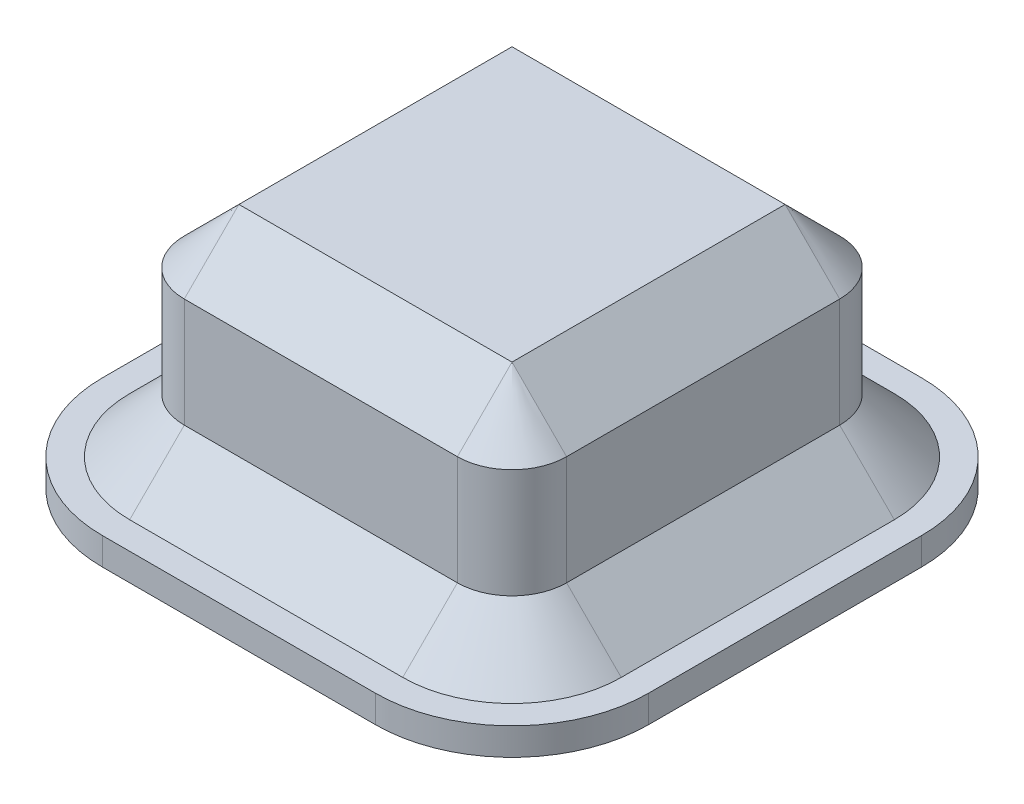
ISO-10303-21;
HEADER;
FILE_DESCRIPTION(('STEP AP214'),'2;1');
FILE_NAME('part.step','',(''),(''),'','','');
FILE_SCHEMA(('AUTOMOTIVE_DESIGN { 1 0 10303 214 1 1 1 1 }'));
ENDSEC;
DATA;
#1=APPLICATION_CONTEXT('core data for automotive mechanical design processes');
#2=APPLICATION_PROTOCOL_DEFINITION('international standard','automotive_design',2000,#1);
#3=PRODUCT_CONTEXT('',#1,'mechanical');
#4=PRODUCT('Part','Part','',(#3));
#5=PRODUCT_RELATED_PRODUCT_CATEGORY('part','',(#4));
#6=PRODUCT_DEFINITION_FORMATION('','',#4);
#7=PRODUCT_DEFINITION_CONTEXT('part definition',#1,'design');
#8=PRODUCT_DEFINITION('design','',#6,#7);
#9=PRODUCT_DEFINITION_SHAPE('','',#8);
#10=(LENGTH_UNIT() NAMED_UNIT(*) SI_UNIT(.MILLI.,.METRE.));
#11=(NAMED_UNIT(*) PLANE_ANGLE_UNIT() SI_UNIT($,.RADIAN.));
#12=(NAMED_UNIT(*) SI_UNIT($,.STERADIAN.) SOLID_ANGLE_UNIT());
#13=UNCERTAINTY_MEASURE_WITH_UNIT(LENGTH_MEASURE(1.E-05),#10,'distance_accuracy_value','');
#14=(GEOMETRIC_REPRESENTATION_CONTEXT(3) GLOBAL_UNCERTAINTY_ASSIGNED_CONTEXT((#13)) GLOBAL_UNIT_ASSIGNED_CONTEXT((#10,
#11,#12)) REPRESENTATION_CONTEXT('',''));
#15=CARTESIAN_POINT('',(0.,0.,0.));
#16=DIRECTION('',(0.,0.,1.));
#17=DIRECTION('',(1.,0.,0.));
#18=AXIS2_PLACEMENT_3D('',#15,#16,#17);
#19=CARTESIAN_POINT('',(10.,1.,-10.));
#20=DIRECTION('',(-1.,0.,0.));
#21=DIRECTION('',(0.,0.,1.));
#22=AXIS2_PLACEMENT_3D('',#19,#20,#21);
#23=PLANE('',#22);
#24=DIRECTION('',(0.,0.,-1.));
#25=VECTOR('',#24,1.);
#26=CARTESIAN_POINT('',(10.,0.,-10.));
#27=LINE('',#26,#25);
#28=CARTESIAN_POINT('',(10.,0.,5.));
#29=VERTEX_POINT('',#28);
#30=CARTESIAN_POINT('',(10.,0.,-5.));
#31=VERTEX_POINT('',#30);
#32=EDGE_CURVE('E452',#29,#31,#27,.T.);
#33=ORIENTED_EDGE('',*,*,#32,.T.);
#34=DIRECTION('',(0.,-1.,0.));
#35=VECTOR('',#34,1.);
#36=CARTESIAN_POINT('',(10.,1.,-5.));
#37=LINE('',#36,#35);
#38=CARTESIAN_POINT('',(10.,1.,-5.));
#39=VERTEX_POINT('',#38);
#40=EDGE_CURVE('E266',#31,#39,#37,.F.);
#41=ORIENTED_EDGE('',*,*,#40,.T.);
#42=DIRECTION('',(0.,0.,-1.));
#43=VECTOR('',#42,1.);
#44=CARTESIAN_POINT('',(10.,1.,-10.));
#45=LINE('',#44,#43);
#46=CARTESIAN_POINT('',(10.,1.,5.));
#47=VERTEX_POINT('',#46);
#48=EDGE_CURVE('E217',#47,#39,#45,.T.);
#49=ORIENTED_EDGE('',*,*,#48,.F.);
#50=DIRECTION('',(0.,-1.,0.));
#51=VECTOR('',#50,1.);
#52=CARTESIAN_POINT('',(10.,1.,5.));
#53=LINE('',#52,#51);
#54=EDGE_CURVE('E262',#47,#29,#53,.T.);
#55=ORIENTED_EDGE('',*,*,#54,.T.);
#56=EDGE_LOOP('',(#33,#41,#49,#55));
#57=FACE_BOUND('',#56,.T.);
#58=ADVANCED_FACE('F38',(#57),#23,.F.);
#59=CARTESIAN_POINT('',(-10.,1.,-10.));
#60=DIRECTION('',(0.,0.,1.));
#61=DIRECTION('',(1.,0.,0.));
#62=AXIS2_PLACEMENT_3D('',#59,#60,#61);
#63=PLANE('',#62);
#64=DIRECTION('',(-1.,0.,0.));
#65=VECTOR('',#64,1.);
#66=CARTESIAN_POINT('',(-10.,0.,-10.));
#67=LINE('',#66,#65);
#68=CARTESIAN_POINT('',(5.,0.,-10.));
#69=VERTEX_POINT('',#68);
#70=CARTESIAN_POINT('',(-5.,0.,-10.));
#71=VERTEX_POINT('',#70);
#72=EDGE_CURVE('E225',#69,#71,#67,.T.);
#73=ORIENTED_EDGE('',*,*,#72,.T.);
#74=DIRECTION('',(0.,-1.,0.));
#75=VECTOR('',#74,1.);
#76=CARTESIAN_POINT('',(-5.,1.,-10.));
#77=LINE('',#76,#75);
#78=CARTESIAN_POINT('',(-5.,1.,-10.));
#79=VERTEX_POINT('',#78);
#80=EDGE_CURVE('E259',#71,#79,#77,.F.);
#81=ORIENTED_EDGE('',*,*,#80,.T.);
#82=DIRECTION('',(-1.,0.,0.));
#83=VECTOR('',#82,1.);
#84=CARTESIAN_POINT('',(-10.,1.,-10.));
#85=LINE('',#84,#83);
#86=CARTESIAN_POINT('',(5.,1.,-10.));
#87=VERTEX_POINT('',#86);
#88=EDGE_CURVE('E223',#87,#79,#85,.T.);
#89=ORIENTED_EDGE('',*,*,#88,.F.);
#90=DIRECTION('',(0.,-1.,0.));
#91=VECTOR('',#90,1.);
#92=CARTESIAN_POINT('',(5.,1.,-10.));
#93=LINE('',#92,#91);
#94=EDGE_CURVE('E255',#87,#69,#93,.T.);
#95=ORIENTED_EDGE('',*,*,#94,.T.);
#96=EDGE_LOOP('',(#73,#81,#89,#95));
#97=FACE_BOUND('',#96,.T.);
#98=ADVANCED_FACE('F470',(#97),#63,.F.);
#99=CARTESIAN_POINT('',(-10.,1.,-10.));
#100=DIRECTION('',(1.,0.,0.));
#101=DIRECTION('',(0.,0.,-1.));
#102=AXIS2_PLACEMENT_3D('',#99,#100,#101);
#103=PLANE('',#102);
#104=DIRECTION('',(0.,0.,1.));
#105=VECTOR('',#104,1.);
#106=CARTESIAN_POINT('',(-10.,0.,-10.));
#107=LINE('',#106,#105);
#108=CARTESIAN_POINT('',(-10.,0.,-5.));
#109=VERTEX_POINT('',#108);
#110=CARTESIAN_POINT('',(-10.,0.,5.));
#111=VERTEX_POINT('',#110);
#112=EDGE_CURVE('E218',#109,#111,#107,.T.);
#113=ORIENTED_EDGE('',*,*,#112,.T.);
#114=DIRECTION('',(0.,-1.,0.));
#115=VECTOR('',#114,1.);
#116=CARTESIAN_POINT('',(-10.,1.,5.));
#117=LINE('',#116,#115);
#118=CARTESIAN_POINT('',(-10.,1.,5.));
#119=VERTEX_POINT('',#118);
#120=EDGE_CURVE('E193',#111,#119,#117,.F.);
#121=ORIENTED_EDGE('',*,*,#120,.T.);
#122=DIRECTION('',(0.,0.,1.));
#123=VECTOR('',#122,1.);
#124=CARTESIAN_POINT('',(-10.,1.,-10.));
#125=LINE('',#124,#123);
#126=CARTESIAN_POINT('',(-10.,1.,-5.));
#127=VERTEX_POINT('',#126);
#128=EDGE_CURVE('E457',#127,#119,#125,.T.);
#129=ORIENTED_EDGE('',*,*,#128,.F.);
#130=DIRECTION('',(0.,-1.,0.));
#131=VECTOR('',#130,1.);
#132=CARTESIAN_POINT('',(-10.,1.,-5.));
#133=LINE('',#132,#131);
#134=EDGE_CURVE('E199',#127,#109,#133,.T.);
#135=ORIENTED_EDGE('',*,*,#134,.T.);
#136=EDGE_LOOP('',(#113,#121,#129,#135));
#137=FACE_BOUND('',#136,.T.);
#138=ADVANCED_FACE('F481',(#137),#103,.F.);
#139=CARTESIAN_POINT('',(-10.,1.,10.));
#140=DIRECTION('',(0.,0.,-1.));
#141=DIRECTION('',(-1.,0.,0.));
#142=AXIS2_PLACEMENT_3D('',#139,#140,#141);
#143=PLANE('',#142);
#144=DIRECTION('',(1.,0.,0.));
#145=VECTOR('',#144,1.);
#146=CARTESIAN_POINT('',(-10.,1.,10.));
#147=LINE('',#146,#145);
#148=CARTESIAN_POINT('',(-5.,1.,10.));
#149=VERTEX_POINT('',#148);
#150=CARTESIAN_POINT('',(5.,1.,10.));
#151=VERTEX_POINT('',#150);
#152=EDGE_CURVE('E209',#149,#151,#147,.T.);
#153=ORIENTED_EDGE('',*,*,#152,.F.);
#154=DIRECTION('',(0.,-1.,0.));
#155=VECTOR('',#154,1.);
#156=CARTESIAN_POINT('',(-5.,1.,10.));
#157=LINE('',#156,#155);
#158=CARTESIAN_POINT('',(-5.,0.,10.));
#159=VERTEX_POINT('',#158);
#160=EDGE_CURVE('E192',#149,#159,#157,.T.);
#161=ORIENTED_EDGE('',*,*,#160,.T.);
#162=DIRECTION('',(1.,0.,0.));
#163=VECTOR('',#162,1.);
#164=CARTESIAN_POINT('',(-10.,0.,10.));
#165=LINE('',#164,#163);
#166=CARTESIAN_POINT('',(5.,0.,10.));
#167=VERTEX_POINT('',#166);
#168=EDGE_CURVE('E206',#159,#167,#165,.T.);
#169=ORIENTED_EDGE('',*,*,#168,.T.);
#170=DIRECTION('',(0.,-1.,0.));
#171=VECTOR('',#170,1.);
#172=CARTESIAN_POINT('',(5.,1.,10.));
#173=LINE('',#172,#171);
#174=EDGE_CURVE('E212',#167,#151,#173,.F.);
#175=ORIENTED_EDGE('',*,*,#174,.T.);
#176=EDGE_LOOP('',(#153,#161,#169,#175));
#177=FACE_BOUND('',#176,.T.);
#178=ADVANCED_FACE('F205',(#177),#143,.F.);
#179=CARTESIAN_POINT('',(0.,1.,0.));
#180=DIRECTION('',(0.,1.,0.));
#181=DIRECTION('',(0.,0.,1.));
#182=AXIS2_PLACEMENT_3D('',#179,#180,#181);
#183=PLANE('',#182);
#184=DIRECTION('',(0.,0.,1.));
#185=VECTOR('',#184,1.);
#186=CARTESIAN_POINT('',(9.,1.,0.));
#187=LINE('',#186,#185);
#188=CARTESIAN_POINT('',(9.,1.,-5.));
#189=VERTEX_POINT('',#188);
#190=CARTESIAN_POINT('',(9.,1.,5.));
#191=VERTEX_POINT('',#190);
#192=EDGE_CURVE('E291',#189,#191,#187,.T.);
#193=ORIENTED_EDGE('',*,*,#192,.T.);
#194=CARTESIAN_POINT('',(5.,1.,5.));
#195=DIRECTION('',(0.,1.,0.));
#196=DIRECTION('',(0.,0.,1.));
#197=AXIS2_PLACEMENT_3D('',#194,#195,#196);
#198=CIRCLE('',#197,4.);
#199=CARTESIAN_POINT('',(5.,1.,8.99999999999999));
#200=VERTEX_POINT('',#199);
#201=EDGE_CURVE('E294',#191,#200,#198,.F.);
#202=ORIENTED_EDGE('',*,*,#201,.T.);
#203=DIRECTION('',(-1.,0.,0.));
#204=VECTOR('',#203,1.);
#205=CARTESIAN_POINT('',(0.,1.,8.99999999999999));
#206=LINE('',#205,#204);
#207=CARTESIAN_POINT('',(-5.,1.,8.99999999999999));
#208=VERTEX_POINT('',#207);
#209=EDGE_CURVE('E279',#200,#208,#206,.T.);
#210=ORIENTED_EDGE('',*,*,#209,.T.);
#211=CARTESIAN_POINT('',(-5.,1.,5.));
#212=DIRECTION('',(0.,1.,0.));
#213=DIRECTION('',(0.,0.,1.));
#214=AXIS2_PLACEMENT_3D('',#211,#212,#213);
#215=CIRCLE('',#214,4.);
#216=CARTESIAN_POINT('',(-8.99999999999999,1.,5.));
#217=VERTEX_POINT('',#216);
#218=EDGE_CURVE('E276',#208,#217,#215,.F.);
#219=ORIENTED_EDGE('',*,*,#218,.T.);
#220=DIRECTION('',(0.,0.,-1.));
#221=VECTOR('',#220,1.);
#222=CARTESIAN_POINT('',(-8.99999999999999,1.,0.));
#223=LINE('',#222,#221);
#224=CARTESIAN_POINT('',(-8.99999999999999,1.,-5.));
#225=VERTEX_POINT('',#224);
#226=EDGE_CURVE('E273',#217,#225,#223,.T.);
#227=ORIENTED_EDGE('',*,*,#226,.T.);
#228=CARTESIAN_POINT('',(-5.,1.,-5.));
#229=DIRECTION('',(0.,1.,0.));
#230=DIRECTION('',(0.,0.,1.));
#231=AXIS2_PLACEMENT_3D('',#228,#229,#230);
#232=CIRCLE('',#231,4.);
#233=CARTESIAN_POINT('',(-5.,1.,-9.));
#234=VERTEX_POINT('',#233);
#235=EDGE_CURVE('E282',#225,#234,#232,.F.);
#236=ORIENTED_EDGE('',*,*,#235,.T.);
#237=DIRECTION('',(1.,0.,0.));
#238=VECTOR('',#237,1.);
#239=CARTESIAN_POINT('',(0.,1.,-9.));
#240=LINE('',#239,#238);
#241=CARTESIAN_POINT('',(5.,1.,-9.));
#242=VERTEX_POINT('',#241);
#243=EDGE_CURVE('E285',#234,#242,#240,.T.);
#244=ORIENTED_EDGE('',*,*,#243,.T.);
#245=CARTESIAN_POINT('',(5.,1.,-5.));
#246=DIRECTION('',(0.,1.,0.));
#247=DIRECTION('',(0.,0.,1.));
#248=AXIS2_PLACEMENT_3D('',#245,#246,#247);
#249=CIRCLE('',#248,4.);
#250=EDGE_CURVE('E288',#242,#189,#249,.F.);
#251=ORIENTED_EDGE('',*,*,#250,.T.);
#252=EDGE_LOOP('',(#193,#202,#210,#219,#227,#236,#244,#251));
#253=FACE_BOUND('',#252,.T.);
#254=ORIENTED_EDGE('',*,*,#128,.T.);
#255=CARTESIAN_POINT('',(-5.,1.,5.));
#256=DIRECTION('',(0.,1.,0.));
#257=DIRECTION('',(0.,0.,1.));
#258=AXIS2_PLACEMENT_3D('',#255,#256,#257);
#259=CIRCLE('',#258,5.);
#260=EDGE_CURVE('E252',#119,#149,#259,.T.);
#261=ORIENTED_EDGE('',*,*,#260,.T.);
#262=ORIENTED_EDGE('',*,*,#152,.T.);
#263=CARTESIAN_POINT('',(5.,1.,5.));
#264=DIRECTION('',(0.,1.,0.));
#265=DIRECTION('',(0.,0.,1.));
#266=AXIS2_PLACEMENT_3D('',#263,#264,#265);
#267=CIRCLE('',#266,5.);
#268=EDGE_CURVE('E243',#151,#47,#267,.T.);
#269=ORIENTED_EDGE('',*,*,#268,.T.);
#270=ORIENTED_EDGE('',*,*,#48,.T.);
#271=CARTESIAN_POINT('',(5.,1.,-5.));
#272=DIRECTION('',(0.,1.,0.));
#273=DIRECTION('',(0.,0.,1.));
#274=AXIS2_PLACEMENT_3D('',#271,#272,#273);
#275=CIRCLE('',#274,5.);
#276=EDGE_CURVE('E246',#39,#87,#275,.T.);
#277=ORIENTED_EDGE('',*,*,#276,.T.);
#278=ORIENTED_EDGE('',*,*,#88,.T.);
#279=CARTESIAN_POINT('',(-5.,1.,-5.));
#280=DIRECTION('',(0.,1.,0.));
#281=DIRECTION('',(0.,0.,1.));
#282=AXIS2_PLACEMENT_3D('',#279,#280,#281);
#283=CIRCLE('',#282,5.);
#284=EDGE_CURVE('E249',#79,#127,#283,.T.);
#285=ORIENTED_EDGE('',*,*,#284,.T.);
#286=EDGE_LOOP('',(#254,#261,#262,#269,#270,#277,#278,#285));
#287=FACE_BOUND('',#286,.T.);
#288=ADVANCED_FACE('F479',(#253,#287),#183,.T.);
#289=CARTESIAN_POINT('',(0.,0.,0.));
#290=DIRECTION('',(0.,1.,0.));
#291=DIRECTION('',(0.,0.,1.));
#292=AXIS2_PLACEMENT_3D('',#289,#290,#291);
#293=PLANE('',#292);
#294=ORIENTED_EDGE('',*,*,#168,.F.);
#295=CARTESIAN_POINT('',(-5.,0.,5.));
#296=DIRECTION('',(0.,1.,0.));
#297=DIRECTION('',(0.,0.,1.));
#298=AXIS2_PLACEMENT_3D('',#295,#296,#297);
#299=CIRCLE('',#298,5.);
#300=EDGE_CURVE('E188',#159,#111,#299,.F.);
#301=ORIENTED_EDGE('',*,*,#300,.T.);
#302=ORIENTED_EDGE('',*,*,#112,.F.);
#303=CARTESIAN_POINT('',(-5.,0.,-5.));
#304=DIRECTION('',(0.,1.,0.));
#305=DIRECTION('',(0.,0.,1.));
#306=AXIS2_PLACEMENT_3D('',#303,#304,#305);
#307=CIRCLE('',#306,5.);
#308=EDGE_CURVE('E200',#109,#71,#307,.F.);
#309=ORIENTED_EDGE('',*,*,#308,.T.);
#310=ORIENTED_EDGE('',*,*,#72,.F.);
#311=CARTESIAN_POINT('',(5.,0.,-5.));
#312=DIRECTION('',(0.,1.,0.));
#313=DIRECTION('',(0.,0.,1.));
#314=AXIS2_PLACEMENT_3D('',#311,#312,#313);
#315=CIRCLE('',#314,5.);
#316=EDGE_CURVE('E233',#69,#31,#315,.F.);
#317=ORIENTED_EDGE('',*,*,#316,.T.);
#318=ORIENTED_EDGE('',*,*,#32,.F.);
#319=CARTESIAN_POINT('',(5.,0.,5.));
#320=DIRECTION('',(0.,1.,0.));
#321=DIRECTION('',(0.,0.,1.));
#322=AXIS2_PLACEMENT_3D('',#319,#320,#321);
#323=CIRCLE('',#322,5.);
#324=EDGE_CURVE('E211',#29,#167,#323,.F.);
#325=ORIENTED_EDGE('',*,*,#324,.T.);
#326=EDGE_LOOP('',(#294,#301,#302,#309,#310,#317,#318,#325));
#327=FACE_BOUND('',#326,.T.);
#328=ADVANCED_FACE('F214',(#327),#293,.F.);
#329=CARTESIAN_POINT('',(-5.,1.,5.));
#330=DIRECTION('',(0.,-1.,0.));
#331=DIRECTION('',(0.,0.,-1.));
#332=AXIS2_PLACEMENT_3D('',#329,#330,#331);
#333=CYLINDRICAL_SURFACE('',#332,5.);
#334=ORIENTED_EDGE('',*,*,#260,.F.);
#335=ORIENTED_EDGE('',*,*,#120,.F.);
#336=ORIENTED_EDGE('',*,*,#300,.F.);
#337=ORIENTED_EDGE('',*,*,#160,.F.);
#338=EDGE_LOOP('',(#334,#335,#336,#337));
#339=FACE_BOUND('',#338,.T.);
#340=ADVANCED_FACE('F191',(#339),#333,.T.);
#341=CARTESIAN_POINT('',(-5.,1.,-5.));
#342=DIRECTION('',(0.,-1.,0.));
#343=DIRECTION('',(0.,0.,-1.));
#344=AXIS2_PLACEMENT_3D('',#341,#342,#343);
#345=CYLINDRICAL_SURFACE('',#344,5.);
#346=ORIENTED_EDGE('',*,*,#284,.F.);
#347=ORIENTED_EDGE('',*,*,#80,.F.);
#348=ORIENTED_EDGE('',*,*,#308,.F.);
#349=ORIENTED_EDGE('',*,*,#134,.F.);
#350=EDGE_LOOP('',(#346,#347,#348,#349));
#351=FACE_BOUND('',#350,.T.);
#352=ADVANCED_FACE('F475',(#351),#345,.T.);
#353=CARTESIAN_POINT('',(5.,1.,-5.));
#354=DIRECTION('',(0.,-1.,0.));
#355=DIRECTION('',(0.,0.,-1.));
#356=AXIS2_PLACEMENT_3D('',#353,#354,#355);
#357=CYLINDRICAL_SURFACE('',#356,5.);
#358=ORIENTED_EDGE('',*,*,#276,.F.);
#359=ORIENTED_EDGE('',*,*,#40,.F.);
#360=ORIENTED_EDGE('',*,*,#316,.F.);
#361=ORIENTED_EDGE('',*,*,#94,.F.);
#362=EDGE_LOOP('',(#358,#359,#360,#361));
#363=FACE_BOUND('',#362,.T.);
#364=ADVANCED_FACE('F500',(#363),#357,.T.);
#365=CARTESIAN_POINT('',(5.,1.,5.));
#366=DIRECTION('',(0.,-1.,0.));
#367=DIRECTION('',(0.,0.,-1.));
#368=AXIS2_PLACEMENT_3D('',#365,#366,#367);
#369=CYLINDRICAL_SURFACE('',#368,5.);
#370=ORIENTED_EDGE('',*,*,#268,.F.);
#371=ORIENTED_EDGE('',*,*,#174,.F.);
#372=ORIENTED_EDGE('',*,*,#324,.F.);
#373=ORIENTED_EDGE('',*,*,#54,.F.);
#374=EDGE_LOOP('',(#370,#371,#372,#373));
#375=FACE_BOUND('',#374,.T.);
#376=ADVANCED_FACE('F503',(#375),#369,.T.);
#377=CARTESIAN_POINT('',(-5.,9.,-5.));
#378=DIRECTION('',(0.,-1.,0.));
#379=DIRECTION('',(0.,0.,-1.));
#380=AXIS2_PLACEMENT_3D('',#377,#378,#379);
#381=CYLINDRICAL_SURFACE('',#380,2.);
#382=DIRECTION('',(0.,-1.,0.));
#383=VECTOR('',#382,1.);
#384=CARTESIAN_POINT('',(-7.,9.,-5.));
#385=LINE('',#384,#383);
#386=CARTESIAN_POINT('',(-7.,7.,-5.));
#387=VERTEX_POINT('',#386);
#388=CARTESIAN_POINT('',(-7.,3.00000000000002,-5.));
#389=VERTEX_POINT('',#388);
#390=EDGE_CURVE('E450',#387,#389,#385,.T.);
#391=ORIENTED_EDGE('',*,*,#390,.F.);
#392=CARTESIAN_POINT('',(-5.,7.,-5.));
#393=DIRECTION('',(0.,1.,0.));
#394=DIRECTION('',(0.,0.,1.));
#395=AXIS2_PLACEMENT_3D('',#392,#393,#394);
#396=CIRCLE('',#395,2.);
#397=CARTESIAN_POINT('',(-5.,7.,-7.));
#398=VERTEX_POINT('',#397);
#399=EDGE_CURVE('E326',#387,#398,#396,.F.);
#400=ORIENTED_EDGE('',*,*,#399,.T.);
#401=DIRECTION('',(0.,-1.,0.));
#402=VECTOR('',#401,1.);
#403=CARTESIAN_POINT('',(-5.,9.,-7.));
#404=LINE('',#403,#402);
#405=CARTESIAN_POINT('',(-5.,3.00000000000002,-7.));
#406=VERTEX_POINT('',#405);
#407=EDGE_CURVE('E358',#398,#406,#404,.T.);
#408=ORIENTED_EDGE('',*,*,#407,.T.);
#409=CARTESIAN_POINT('',(-5.,3.00000000000002,-5.));
#410=DIRECTION('',(0.,1.,0.));
#411=DIRECTION('',(0.,0.,1.));
#412=AXIS2_PLACEMENT_3D('',#409,#410,#411);
#413=CIRCLE('',#412,2.);
#414=EDGE_CURVE('E310',#406,#389,#413,.T.);
#415=ORIENTED_EDGE('',*,*,#414,.T.);
#416=EDGE_LOOP('',(#391,#400,#408,#415));
#417=FACE_BOUND('',#416,.T.);
#418=ADVANCED_FACE('F507',(#417),#381,.T.);
#419=CARTESIAN_POINT('',(-7.,9.,-5.));
#420=DIRECTION('',(1.,0.,0.));
#421=DIRECTION('',(0.,0.,-1.));
#422=AXIS2_PLACEMENT_3D('',#419,#420,#421);
#423=PLANE('',#422);
#424=DIRECTION('',(0.,-1.,0.));
#425=VECTOR('',#424,1.);
#426=CARTESIAN_POINT('',(-7.,9.,5.));
#427=LINE('',#426,#425);
#428=CARTESIAN_POINT('',(-7.,7.,5.));
#429=VERTEX_POINT('',#428);
#430=CARTESIAN_POINT('',(-7.,3.00000000000002,5.));
#431=VERTEX_POINT('',#430);
#432=EDGE_CURVE('E442',#429,#431,#427,.T.);
#433=ORIENTED_EDGE('',*,*,#432,.F.);
#434=DIRECTION('',(0.,0.,-1.));
#435=VECTOR('',#434,1.);
#436=CARTESIAN_POINT('',(-7.,7.,-5.));
#437=LINE('',#436,#435);
#438=EDGE_CURVE('E387',#429,#387,#437,.T.);
#439=ORIENTED_EDGE('',*,*,#438,.T.);
#440=ORIENTED_EDGE('',*,*,#390,.T.);
#441=DIRECTION('',(0.,0.,1.));
#442=VECTOR('',#441,1.);
#443=CARTESIAN_POINT('',(-7.,3.00000000000002,-5.));
#444=LINE('',#443,#442);
#445=EDGE_CURVE('E322',#389,#431,#444,.T.);
#446=ORIENTED_EDGE('',*,*,#445,.T.);
#447=EDGE_LOOP('',(#433,#439,#440,#446));
#448=FACE_BOUND('',#447,.T.);
#449=ADVANCED_FACE('F667',(#448),#423,.F.);
#450=CARTESIAN_POINT('',(-5.,9.,5.));
#451=DIRECTION('',(0.,-1.,0.));
#452=DIRECTION('',(0.,0.,-1.));
#453=AXIS2_PLACEMENT_3D('',#450,#451,#452);
#454=CYLINDRICAL_SURFACE('',#453,2.);
#455=DIRECTION('',(0.,-1.,0.));
#456=VECTOR('',#455,1.);
#457=CARTESIAN_POINT('',(-5.,9.,7.));
#458=LINE('',#457,#456);
#459=CARTESIAN_POINT('',(-5.,7.,7.));
#460=VERTEX_POINT('',#459);
#461=CARTESIAN_POINT('',(-5.,3.00000000000002,7.));
#462=VERTEX_POINT('',#461);
#463=EDGE_CURVE('E438',#460,#462,#458,.T.);
#464=ORIENTED_EDGE('',*,*,#463,.F.);
#465=CARTESIAN_POINT('',(-5.,7.,5.));
#466=DIRECTION('',(0.,1.,0.));
#467=DIRECTION('',(0.,0.,1.));
#468=AXIS2_PLACEMENT_3D('',#465,#466,#467);
#469=CIRCLE('',#468,2.);
#470=EDGE_CURVE('E48',#460,#429,#469,.F.);
#471=ORIENTED_EDGE('',*,*,#470,.T.);
#472=ORIENTED_EDGE('',*,*,#432,.T.);
#473=CARTESIAN_POINT('',(-5.,3.00000000000002,5.));
#474=DIRECTION('',(0.,1.,0.));
#475=DIRECTION('',(0.,0.,1.));
#476=AXIS2_PLACEMENT_3D('',#473,#474,#475);
#477=CIRCLE('',#476,2.);
#478=EDGE_CURVE('E318',#431,#462,#477,.T.);
#479=ORIENTED_EDGE('',*,*,#478,.T.);
#480=EDGE_LOOP('',(#464,#471,#472,#479));
#481=FACE_BOUND('',#480,.T.);
#482=ADVANCED_FACE('F658',(#481),#454,.T.);
#483=CARTESIAN_POINT('',(-5.,9.,7.));
#484=DIRECTION('',(0.,0.,-1.));
#485=DIRECTION('',(-1.,0.,0.));
#486=AXIS2_PLACEMENT_3D('',#483,#484,#485);
#487=PLANE('',#486);
#488=DIRECTION('',(0.,-1.,0.));
#489=VECTOR('',#488,1.);
#490=CARTESIAN_POINT('',(5.,9.,7.));
#491=LINE('',#490,#489);
#492=CARTESIAN_POINT('',(5.,7.,7.));
#493=VERTEX_POINT('',#492);
#494=CARTESIAN_POINT('',(5.,3.00000000000002,7.));
#495=VERTEX_POINT('',#494);
#496=EDGE_CURVE('E432',#493,#495,#491,.T.);
#497=ORIENTED_EDGE('',*,*,#496,.F.);
#498=DIRECTION('',(-1.,0.,0.));
#499=VECTOR('',#498,1.);
#500=CARTESIAN_POINT('',(-5.,7.,7.));
#501=LINE('',#500,#499);
#502=EDGE_CURVE('E11',#493,#460,#501,.T.);
#503=ORIENTED_EDGE('',*,*,#502,.T.);
#504=ORIENTED_EDGE('',*,*,#463,.T.);
#505=DIRECTION('',(1.,0.,0.));
#506=VECTOR('',#505,1.);
#507=CARTESIAN_POINT('',(-5.,3.00000000000002,7.));
#508=LINE('',#507,#506);
#509=EDGE_CURVE('E314',#462,#495,#508,.T.);
#510=ORIENTED_EDGE('',*,*,#509,.T.);
#511=EDGE_LOOP('',(#497,#503,#504,#510));
#512=FACE_BOUND('',#511,.T.);
#513=ADVANCED_FACE('F434',(#512),#487,.F.);
#514=CARTESIAN_POINT('',(5.,9.,5.));
#515=DIRECTION('',(0.,-1.,0.));
#516=DIRECTION('',(0.,0.,-1.));
#517=AXIS2_PLACEMENT_3D('',#514,#515,#516);
#518=CYLINDRICAL_SURFACE('',#517,2.);
#519=DIRECTION('',(0.,-1.,0.));
#520=VECTOR('',#519,1.);
#521=CARTESIAN_POINT('',(7.,9.,5.));
#522=LINE('',#521,#520);
#523=CARTESIAN_POINT('',(7.,7.,5.));
#524=VERTEX_POINT('',#523);
#525=CARTESIAN_POINT('',(7.,3.00000000000002,5.));
#526=VERTEX_POINT('',#525);
#527=EDGE_CURVE('E433',#524,#526,#522,.T.);
#528=ORIENTED_EDGE('',*,*,#527,.F.);
#529=CARTESIAN_POINT('',(5.,7.,5.));
#530=DIRECTION('',(0.,1.,0.));
#531=DIRECTION('',(0.,0.,1.));
#532=AXIS2_PLACEMENT_3D('',#529,#530,#531);
#533=CIRCLE('',#532,2.);
#534=EDGE_CURVE('E384',#524,#493,#533,.F.);
#535=ORIENTED_EDGE('',*,*,#534,.T.);
#536=ORIENTED_EDGE('',*,*,#496,.T.);
#537=CARTESIAN_POINT('',(5.,3.00000000000002,5.));
#538=DIRECTION('',(0.,1.,0.));
#539=DIRECTION('',(0.,0.,1.));
#540=AXIS2_PLACEMENT_3D('',#537,#538,#539);
#541=CIRCLE('',#540,2.);
#542=EDGE_CURVE('E269',#495,#526,#541,.T.);
#543=ORIENTED_EDGE('',*,*,#542,.T.);
#544=EDGE_LOOP('',(#528,#535,#536,#543));
#545=FACE_BOUND('',#544,.T.);
#546=ADVANCED_FACE('F431',(#545),#518,.T.);
#547=CARTESIAN_POINT('',(7.,9.,5.));
#548=DIRECTION('',(-1.,0.,0.));
#549=DIRECTION('',(0.,0.,1.));
#550=AXIS2_PLACEMENT_3D('',#547,#548,#549);
#551=PLANE('',#550);
#552=DIRECTION('',(0.,-1.,0.));
#553=VECTOR('',#552,1.);
#554=CARTESIAN_POINT('',(7.,9.,-5.));
#555=LINE('',#554,#553);
#556=CARTESIAN_POINT('',(7.,7.,-5.));
#557=VERTEX_POINT('',#556);
#558=CARTESIAN_POINT('',(7.,3.00000000000002,-5.));
#559=VERTEX_POINT('',#558);
#560=EDGE_CURVE('E444',#557,#559,#555,.T.);
#561=ORIENTED_EDGE('',*,*,#560,.F.);
#562=DIRECTION('',(0.,0.,1.));
#563=VECTOR('',#562,1.);
#564=CARTESIAN_POINT('',(7.,7.,5.));
#565=LINE('',#564,#563);
#566=EDGE_CURVE('E381',#557,#524,#565,.T.);
#567=ORIENTED_EDGE('',*,*,#566,.T.);
#568=ORIENTED_EDGE('',*,*,#527,.T.);
#569=DIRECTION('',(0.,0.,-1.));
#570=VECTOR('',#569,1.);
#571=CARTESIAN_POINT('',(7.,3.00000000000002,5.));
#572=LINE('',#571,#570);
#573=EDGE_CURVE('E298',#526,#559,#572,.T.);
#574=ORIENTED_EDGE('',*,*,#573,.T.);
#575=EDGE_LOOP('',(#561,#567,#568,#574));
#576=FACE_BOUND('',#575,.T.);
#577=ADVANCED_FACE('F631',(#576),#551,.F.);
#578=CARTESIAN_POINT('',(5.,9.,-5.));
#579=DIRECTION('',(0.,-1.,0.));
#580=DIRECTION('',(0.,0.,-1.));
#581=AXIS2_PLACEMENT_3D('',#578,#579,#580);
#582=CYLINDRICAL_SURFACE('',#581,2.);
#583=DIRECTION('',(0.,-1.,0.));
#584=VECTOR('',#583,1.);
#585=CARTESIAN_POINT('',(5.,9.,-7.));
#586=LINE('',#585,#584);
#587=CARTESIAN_POINT('',(5.,7.,-7.));
#588=VERTEX_POINT('',#587);
#589=CARTESIAN_POINT('',(5.,3.00000000000002,-7.));
#590=VERTEX_POINT('',#589);
#591=EDGE_CURVE('E761',#588,#590,#586,.T.);
#592=ORIENTED_EDGE('',*,*,#591,.F.);
#593=CARTESIAN_POINT('',(5.,7.,-5.));
#594=DIRECTION('',(0.,1.,0.));
#595=DIRECTION('',(0.,0.,1.));
#596=AXIS2_PLACEMENT_3D('',#593,#594,#595);
#597=CIRCLE('',#596,2.);
#598=EDGE_CURVE('E378',#588,#557,#597,.F.);
#599=ORIENTED_EDGE('',*,*,#598,.T.);
#600=ORIENTED_EDGE('',*,*,#560,.T.);
#601=CARTESIAN_POINT('',(5.,3.00000000000002,-5.));
#602=DIRECTION('',(0.,1.,0.));
#603=DIRECTION('',(0.,0.,1.));
#604=AXIS2_PLACEMENT_3D('',#601,#602,#603);
#605=CIRCLE('',#604,2.);
#606=EDGE_CURVE('E302',#559,#590,#605,.T.);
#607=ORIENTED_EDGE('',*,*,#606,.T.);
#608=EDGE_LOOP('',(#592,#599,#600,#607));
#609=FACE_BOUND('',#608,.T.);
#610=ADVANCED_FACE('F621',(#609),#582,.T.);
#611=CARTESIAN_POINT('',(5.,9.,-7.));
#612=DIRECTION('',(0.,0.,1.));
#613=DIRECTION('',(1.,0.,0.));
#614=AXIS2_PLACEMENT_3D('',#611,#612,#613);
#615=PLANE('',#614);
#616=ORIENTED_EDGE('',*,*,#407,.F.);
#617=DIRECTION('',(1.,0.,0.));
#618=VECTOR('',#617,1.);
#619=CARTESIAN_POINT('',(5.,7.,-7.));
#620=LINE('',#619,#618);
#621=EDGE_CURVE('E375',#398,#588,#620,.T.);
#622=ORIENTED_EDGE('',*,*,#621,.T.);
#623=ORIENTED_EDGE('',*,*,#591,.T.);
#624=DIRECTION('',(-1.,0.,0.));
#625=VECTOR('',#624,1.);
#626=CARTESIAN_POINT('',(5.,3.00000000000002,-7.));
#627=LINE('',#626,#625);
#628=EDGE_CURVE('E306',#590,#406,#627,.T.);
#629=ORIENTED_EDGE('',*,*,#628,.T.);
#630=EDGE_LOOP('',(#616,#622,#623,#629));
#631=FACE_BOUND('',#630,.T.);
#632=ADVANCED_FACE('F611',(#631),#615,.F.);
#633=CARTESIAN_POINT('',(-5.,9.,-5.));
#634=DIRECTION('',(0.,1.,0.));
#635=DIRECTION('',(0.,0.,1.));
#636=AXIS2_PLACEMENT_3D('',#633,#634,#635);
#637=PLANE('',#636);
#638=DIRECTION('',(0.,0.,-1.));
#639=VECTOR('',#638,1.);
#640=CARTESIAN_POINT('',(5.,9.,-5.));
#641=LINE('',#640,#639);
#642=CARTESIAN_POINT('',(5.,9.,5.));
#643=VERTEX_POINT('',#642);
#644=CARTESIAN_POINT('',(5.,9.,-5.));
#645=VERTEX_POINT('',#644);
#646=EDGE_CURVE('E368',#643,#645,#641,.T.);
#647=ORIENTED_EDGE('',*,*,#646,.T.);
#648=DIRECTION('',(-1.,0.,0.));
#649=VECTOR('',#648,1.);
#650=CARTESIAN_POINT('',(-5.,9.,-5.));
#651=LINE('',#650,#649);
#652=CARTESIAN_POINT('',(-5.,9.,-5.));
#653=VERTEX_POINT('',#652);
#654=EDGE_CURVE('E371',#645,#653,#651,.T.);
#655=ORIENTED_EDGE('',*,*,#654,.T.);
#656=DIRECTION('',(0.,0.,1.));
#657=VECTOR('',#656,1.);
#658=CARTESIAN_POINT('',(-5.,9.,5.));
#659=LINE('',#658,#657);
#660=CARTESIAN_POINT('',(-5.,9.,5.));
#661=VERTEX_POINT('',#660);
#662=EDGE_CURVE('E365',#653,#661,#659,.T.);
#663=ORIENTED_EDGE('',*,*,#662,.T.);
#664=DIRECTION('',(1.,0.,0.));
#665=VECTOR('',#664,1.);
#666=CARTESIAN_POINT('',(5.,9.,5.));
#667=LINE('',#666,#665);
#668=EDGE_CURVE('E362',#661,#643,#667,.T.);
#669=ORIENTED_EDGE('',*,*,#668,.T.);
#670=EDGE_LOOP('',(#647,#655,#663,#669));
#671=FACE_BOUND('',#670,.T.);
#672=ADVANCED_FACE('F540',(#671),#637,.T.);
#673=CARTESIAN_POINT('',(-5.,3.00000000000002,-5.));
#674=DIRECTION('',(0.,-1.,0.));
#675=DIRECTION('',(0.,0.,-1.));
#676=AXIS2_PLACEMENT_3D('',#673,#674,#675);
#677=CONICAL_SURFACE('',#676,2.,0.785398163397443);
#678=DIRECTION('',(0.,0.707106781186551,0.707106781186544));
#679=VECTOR('',#678,1.);
#680=CARTESIAN_POINT('',(-5.,1.,-9.));
#681=LINE('',#680,#679);
#682=EDGE_CURVE('E350',#234,#406,#681,.T.);
#683=ORIENTED_EDGE('',*,*,#682,.F.);
#684=ORIENTED_EDGE('',*,*,#235,.F.);
#685=DIRECTION('',(-0.707106781186544,-0.707106781186551,0.));
#686=VECTOR('',#685,1.);
#687=CARTESIAN_POINT('',(-7.,3.00000000000002,-5.));
#688=LINE('',#687,#686);
#689=EDGE_CURVE('E354',#389,#225,#688,.T.);
#690=ORIENTED_EDGE('',*,*,#689,.F.);
#691=ORIENTED_EDGE('',*,*,#414,.F.);
#692=EDGE_LOOP('',(#683,#684,#690,#691));
#693=FACE_BOUND('',#692,.T.);
#694=ADVANCED_FACE('F536',(#693),#677,.T.);
#695=CARTESIAN_POINT('',(-7.,3.00000000000002,-5.));
#696=DIRECTION('',(0.707106781186551,-0.707106781186544,0.));
#697=DIRECTION('',(0.,0.,1.));
#698=AXIS2_PLACEMENT_3D('',#695,#696,#697);
#699=PLANE('',#698);
#700=ORIENTED_EDGE('',*,*,#689,.T.);
#701=ORIENTED_EDGE('',*,*,#226,.F.);
#702=DIRECTION('',(-0.707106781186544,-0.707106781186551,0.));
#703=VECTOR('',#702,1.);
#704=CARTESIAN_POINT('',(-7.,3.00000000000002,5.));
#705=LINE('',#704,#703);
#706=EDGE_CURVE('E346',#431,#217,#705,.T.);
#707=ORIENTED_EDGE('',*,*,#706,.F.);
#708=ORIENTED_EDGE('',*,*,#445,.F.);
#709=EDGE_LOOP('',(#700,#701,#707,#708));
#710=FACE_BOUND('',#709,.T.);
#711=ADVANCED_FACE('F532',(#710),#699,.F.);
#712=CARTESIAN_POINT('',(5.,3.00000000000002,-7.));
#713=DIRECTION('',(0.,-0.707106781186544,0.707106781186551));
#714=DIRECTION('',(-1.,0.,0.));
#715=AXIS2_PLACEMENT_3D('',#712,#713,#714);
#716=PLANE('',#715);
#717=ORIENTED_EDGE('',*,*,#682,.T.);
#718=ORIENTED_EDGE('',*,*,#628,.F.);
#719=DIRECTION('',(0.,0.707106781186551,0.707106781186544));
#720=VECTOR('',#719,1.);
#721=CARTESIAN_POINT('',(5.,1.,-9.));
#722=LINE('',#721,#720);
#723=EDGE_CURVE('E342',#242,#590,#722,.T.);
#724=ORIENTED_EDGE('',*,*,#723,.F.);
#725=ORIENTED_EDGE('',*,*,#243,.F.);
#726=EDGE_LOOP('',(#717,#718,#724,#725));
#727=FACE_BOUND('',#726,.T.);
#728=ADVANCED_FACE('F528',(#727),#716,.F.);
#729=CARTESIAN_POINT('',(-5.,3.00000000000002,5.));
#730=DIRECTION('',(0.,-1.,0.));
#731=DIRECTION('',(0.,0.,-1.));
#732=AXIS2_PLACEMENT_3D('',#729,#730,#731);
#733=CONICAL_SURFACE('',#732,2.,0.785398163397443);
#734=ORIENTED_EDGE('',*,*,#706,.T.);
#735=ORIENTED_EDGE('',*,*,#218,.F.);
#736=DIRECTION('',(0.,-0.707106781186551,0.707106781186544));
#737=VECTOR('',#736,1.);
#738=CARTESIAN_POINT('',(-5.,3.00000000000002,7.));
#739=LINE('',#738,#737);
#740=EDGE_CURVE('E338',#462,#208,#739,.T.);
#741=ORIENTED_EDGE('',*,*,#740,.F.);
#742=ORIENTED_EDGE('',*,*,#478,.F.);
#743=EDGE_LOOP('',(#734,#735,#741,#742));
#744=FACE_BOUND('',#743,.T.);
#745=ADVANCED_FACE('F524',(#744),#733,.T.);
#746=CARTESIAN_POINT('',(5.,3.00000000000002,-5.));
#747=DIRECTION('',(0.,-1.,0.));
#748=DIRECTION('',(0.,0.,-1.));
#749=AXIS2_PLACEMENT_3D('',#746,#747,#748);
#750=CONICAL_SURFACE('',#749,2.,0.785398163397443);
#751=ORIENTED_EDGE('',*,*,#723,.T.);
#752=ORIENTED_EDGE('',*,*,#606,.F.);
#753=DIRECTION('',(-0.707106781186544,0.707106781186551,0.));
#754=VECTOR('',#753,1.);
#755=CARTESIAN_POINT('',(9.,1.,-5.));
#756=LINE('',#755,#754);
#757=EDGE_CURVE('E334',#189,#559,#756,.T.);
#758=ORIENTED_EDGE('',*,*,#757,.F.);
#759=ORIENTED_EDGE('',*,*,#250,.F.);
#760=EDGE_LOOP('',(#751,#752,#758,#759));
#761=FACE_BOUND('',#760,.T.);
#762=ADVANCED_FACE('F520',(#761),#750,.T.);
#763=CARTESIAN_POINT('',(-5.,3.00000000000002,7.));
#764=DIRECTION('',(0.,-0.707106781186544,-0.707106781186551));
#765=DIRECTION('',(1.,0.,0.));
#766=AXIS2_PLACEMENT_3D('',#763,#764,#765);
#767=PLANE('',#766);
#768=ORIENTED_EDGE('',*,*,#740,.T.);
#769=ORIENTED_EDGE('',*,*,#209,.F.);
#770=DIRECTION('',(0.,-0.707106781186551,0.707106781186544));
#771=VECTOR('',#770,1.);
#772=CARTESIAN_POINT('',(5.,3.00000000000002,7.));
#773=LINE('',#772,#771);
#774=EDGE_CURVE('E331',#495,#200,#773,.T.);
#775=ORIENTED_EDGE('',*,*,#774,.F.);
#776=ORIENTED_EDGE('',*,*,#509,.F.);
#777=EDGE_LOOP('',(#768,#769,#775,#776));
#778=FACE_BOUND('',#777,.T.);
#779=ADVANCED_FACE('F516',(#778),#767,.F.);
#780=CARTESIAN_POINT('',(7.,3.00000000000002,5.));
#781=DIRECTION('',(-0.707106781186551,-0.707106781186544,0.));
#782=DIRECTION('',(0.,0.,-1.));
#783=AXIS2_PLACEMENT_3D('',#780,#781,#782);
#784=PLANE('',#783);
#785=ORIENTED_EDGE('',*,*,#757,.T.);
#786=ORIENTED_EDGE('',*,*,#573,.F.);
#787=DIRECTION('',(-0.707106781186544,0.707106781186551,0.));
#788=VECTOR('',#787,1.);
#789=CARTESIAN_POINT('',(9.,1.,5.));
#790=LINE('',#789,#788);
#791=EDGE_CURVE('E327',#191,#526,#790,.T.);
#792=ORIENTED_EDGE('',*,*,#791,.F.);
#793=ORIENTED_EDGE('',*,*,#192,.F.);
#794=EDGE_LOOP('',(#785,#786,#792,#793));
#795=FACE_BOUND('',#794,.T.);
#796=ADVANCED_FACE('F512',(#795),#784,.F.);
#797=CARTESIAN_POINT('',(5.,3.00000000000002,5.));
#798=DIRECTION('',(0.,-1.,0.));
#799=DIRECTION('',(0.,0.,-1.));
#800=AXIS2_PLACEMENT_3D('',#797,#798,#799);
#801=CONICAL_SURFACE('',#800,2.,0.785398163397444);
#802=ORIENTED_EDGE('',*,*,#774,.T.);
#803=ORIENTED_EDGE('',*,*,#201,.F.);
#804=ORIENTED_EDGE('',*,*,#791,.T.);
#805=ORIENTED_EDGE('',*,*,#542,.F.);
#806=EDGE_LOOP('',(#802,#803,#804,#805));
#807=FACE_BOUND('',#806,.T.);
#808=ADVANCED_FACE('F509',(#807),#801,.T.);
#809=CARTESIAN_POINT('',(5.,7.,5.));
#810=DIRECTION('',(0.,-1.,0.));
#811=DIRECTION('',(0.,0.,-1.));
#812=AXIS2_PLACEMENT_3D('',#809,#810,#811);
#813=CONICAL_SURFACE('',#812,2.,0.785398163397447);
#814=DIRECTION('',(0.,0.707106781186549,-0.707106781186546));
#815=VECTOR('',#814,1.);
#816=CARTESIAN_POINT('',(5.,7.,7.));
#817=LINE('',#816,#815);
#818=EDGE_CURVE('E413',#493,#643,#817,.T.);
#819=ORIENTED_EDGE('',*,*,#818,.F.);
#820=ORIENTED_EDGE('',*,*,#534,.F.);
#821=DIRECTION('',(0.707106781186546,-0.707106781186548,0.));
#822=VECTOR('',#821,1.);
#823=CARTESIAN_POINT('',(5.,9.,5.));
#824=LINE('',#823,#822);
#825=EDGE_CURVE('E42',#643,#524,#824,.T.);
#826=ORIENTED_EDGE('',*,*,#825,.F.);
#827=EDGE_LOOP('',(#819,#820,#826));
#828=FACE_BOUND('',#827,.T.);
#829=ADVANCED_FACE('F40',(#828),#813,.T.);
#830=CARTESIAN_POINT('',(5.,9.,-5.));
#831=DIRECTION('',(0.707106781186548,0.707106781186546,0.));
#832=DIRECTION('',(0.,0.,1.));
#833=AXIS2_PLACEMENT_3D('',#830,#831,#832);
#834=PLANE('',#833);
#835=ORIENTED_EDGE('',*,*,#825,.T.);
#836=ORIENTED_EDGE('',*,*,#566,.F.);
#837=DIRECTION('',(0.707106781186546,-0.707106781186548,0.));
#838=VECTOR('',#837,1.);
#839=CARTESIAN_POINT('',(5.,9.,-5.));
#840=LINE('',#839,#838);
#841=EDGE_CURVE('E410',#645,#557,#840,.T.);
#842=ORIENTED_EDGE('',*,*,#841,.F.);
#843=ORIENTED_EDGE('',*,*,#646,.F.);
#844=EDGE_LOOP('',(#835,#836,#842,#843));
#845=FACE_BOUND('',#844,.T.);
#846=ADVANCED_FACE('F425',(#845),#834,.T.);
#847=CARTESIAN_POINT('',(-5.,9.,5.));
#848=DIRECTION('',(0.,0.707106781186546,0.707106781186549));
#849=DIRECTION('',(-1.,0.,0.));
#850=AXIS2_PLACEMENT_3D('',#847,#848,#849);
#851=PLANE('',#850);
#852=ORIENTED_EDGE('',*,*,#818,.T.);
#853=ORIENTED_EDGE('',*,*,#668,.F.);
#854=DIRECTION('',(0.,0.707106781186549,-0.707106781186546));
#855=VECTOR('',#854,1.);
#856=CARTESIAN_POINT('',(-5.,7.,7.));
#857=LINE('',#856,#855);
#858=EDGE_CURVE('E406',#460,#661,#857,.T.);
#859=ORIENTED_EDGE('',*,*,#858,.F.);
#860=ORIENTED_EDGE('',*,*,#502,.F.);
#861=EDGE_LOOP('',(#852,#853,#859,#860));
#862=FACE_BOUND('',#861,.T.);
#863=ADVANCED_FACE('F561',(#862),#851,.T.);
#864=CARTESIAN_POINT('',(5.,7.,-5.));
#865=DIRECTION('',(0.,-1.,0.));
#866=DIRECTION('',(0.,0.,-1.));
#867=AXIS2_PLACEMENT_3D('',#864,#865,#866);
#868=CONICAL_SURFACE('',#867,2.,0.785398163397447);
#869=ORIENTED_EDGE('',*,*,#841,.T.);
#870=ORIENTED_EDGE('',*,*,#598,.F.);
#871=DIRECTION('',(0.,-0.707106781186548,-0.707106781186547));
#872=VECTOR('',#871,1.);
#873=CARTESIAN_POINT('',(5.,9.,-5.));
#874=LINE('',#873,#872);
#875=EDGE_CURVE('E402',#645,#588,#874,.T.);
#876=ORIENTED_EDGE('',*,*,#875,.F.);
#877=EDGE_LOOP('',(#869,#870,#876));
#878=FACE_BOUND('',#877,.T.);
#879=ADVANCED_FACE('F557',(#878),#868,.T.);
#880=CARTESIAN_POINT('',(-5.,7.,5.));
#881=DIRECTION('',(0.,-1.,0.));
#882=DIRECTION('',(0.,0.,-1.));
#883=AXIS2_PLACEMENT_3D('',#880,#881,#882);
#884=CONICAL_SURFACE('',#883,2.,0.785398163397447);
#885=ORIENTED_EDGE('',*,*,#470,.F.);
#886=ORIENTED_EDGE('',*,*,#858,.T.);
#887=DIRECTION('',(0.707106781186547,0.707106781186548,0.));
#888=VECTOR('',#887,1.);
#889=CARTESIAN_POINT('',(-7.,7.,5.));
#890=LINE('',#889,#888);
#891=EDGE_CURVE('E398',#429,#661,#890,.T.);
#892=ORIENTED_EDGE('',*,*,#891,.F.);
#893=EDGE_LOOP('',(#885,#886,#892));
#894=FACE_BOUND('',#893,.T.);
#895=ADVANCED_FACE('F553',(#894),#884,.T.);
#896=CARTESIAN_POINT('',(-5.,9.,-5.));
#897=DIRECTION('',(0.,0.707106781186547,-0.707106781186548));
#898=DIRECTION('',(1.,0.,0.));
#899=AXIS2_PLACEMENT_3D('',#896,#897,#898);
#900=PLANE('',#899);
#901=ORIENTED_EDGE('',*,*,#875,.T.);
#902=ORIENTED_EDGE('',*,*,#621,.F.);
#903=DIRECTION('',(0.,-0.707106781186548,-0.707106781186547));
#904=VECTOR('',#903,1.);
#905=CARTESIAN_POINT('',(-5.,9.,-5.));
#906=LINE('',#905,#904);
#907=EDGE_CURVE('E395',#653,#398,#906,.T.);
#908=ORIENTED_EDGE('',*,*,#907,.F.);
#909=ORIENTED_EDGE('',*,*,#654,.F.);
#910=EDGE_LOOP('',(#901,#902,#908,#909));
#911=FACE_BOUND('',#910,.T.);
#912=ADVANCED_FACE('F549',(#911),#900,.T.);
#913=CARTESIAN_POINT('',(-5.,9.,-5.));
#914=DIRECTION('',(-0.707106781186548,0.707106781186547,0.));
#915=DIRECTION('',(0.,0.,-1.));
#916=AXIS2_PLACEMENT_3D('',#913,#914,#915);
#917=PLANE('',#916);
#918=ORIENTED_EDGE('',*,*,#891,.T.);
#919=ORIENTED_EDGE('',*,*,#662,.F.);
#920=DIRECTION('',(0.707106781186547,0.707106781186548,0.));
#921=VECTOR('',#920,1.);
#922=CARTESIAN_POINT('',(-7.,7.,-5.));
#923=LINE('',#922,#921);
#924=EDGE_CURVE('E392',#387,#653,#923,.T.);
#925=ORIENTED_EDGE('',*,*,#924,.F.);
#926=ORIENTED_EDGE('',*,*,#438,.F.);
#927=EDGE_LOOP('',(#918,#919,#925,#926));
#928=FACE_BOUND('',#927,.T.);
#929=ADVANCED_FACE('F545',(#928),#917,.T.);
#930=CARTESIAN_POINT('',(-5.,7.,-5.));
#931=DIRECTION('',(0.,-1.,0.));
#932=DIRECTION('',(0.,0.,-1.));
#933=AXIS2_PLACEMENT_3D('',#930,#931,#932);
#934=CONICAL_SURFACE('',#933,2.,0.785398163397447);
#935=ORIENTED_EDGE('',*,*,#907,.T.);
#936=ORIENTED_EDGE('',*,*,#399,.F.);
#937=ORIENTED_EDGE('',*,*,#924,.T.);
#938=EDGE_LOOP('',(#935,#936,#937));
#939=FACE_BOUND('',#938,.T.);
#940=ADVANCED_FACE('F542',(#939),#934,.T.);
#941=CLOSED_SHELL('',(#58,#98,#138,#178,#288,#328,#340,#352,#364,#376,#418,#449,#482,#513,#546,
#577,#610,#632,#672,#694,#711,#728,#745,#762,#779,#796,#808,#829,#846,#863,#879,#895,#912,#929,#940));
#942=MANIFOLD_SOLID_BREP('B2',#941);
#943=ADVANCED_BREP_SHAPE_REPRESENTATION('',(#18,#942),#14);
#944=SHAPE_DEFINITION_REPRESENTATION(#9,#943);
ENDSEC;
END-ISO-10303-21;
